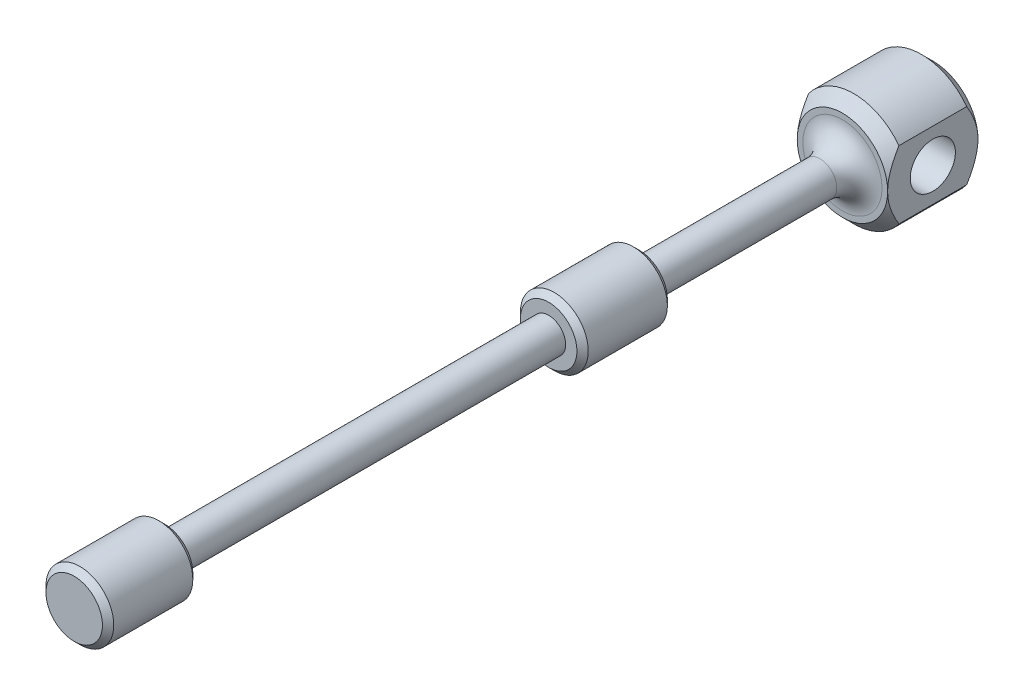
ISO-10303-21;
HEADER;
FILE_DESCRIPTION(('STEP AP214'),'2;1');
FILE_NAME('part.step','',(''),(''),'','','');
FILE_SCHEMA(('AUTOMOTIVE_DESIGN { 1 0 10303 214 1 1 1 1 }'));
ENDSEC;
DATA;
#1=APPLICATION_CONTEXT('core data for automotive mechanical design processes');
#2=APPLICATION_PROTOCOL_DEFINITION('international standard','automotive_design',2000,#1);
#3=PRODUCT_CONTEXT('',#1,'mechanical');
#4=PRODUCT('Part','Part','',(#3));
#5=PRODUCT_RELATED_PRODUCT_CATEGORY('part','',(#4));
#6=PRODUCT_DEFINITION_FORMATION('','',#4);
#7=PRODUCT_DEFINITION_CONTEXT('part definition',#1,'design');
#8=PRODUCT_DEFINITION('design','',#6,#7);
#9=PRODUCT_DEFINITION_SHAPE('','',#8);
#10=(LENGTH_UNIT() NAMED_UNIT(*) SI_UNIT(.MILLI.,.METRE.));
#11=(NAMED_UNIT(*) PLANE_ANGLE_UNIT() SI_UNIT($,.RADIAN.));
#12=(NAMED_UNIT(*) SI_UNIT($,.STERADIAN.) SOLID_ANGLE_UNIT());
#13=UNCERTAINTY_MEASURE_WITH_UNIT(LENGTH_MEASURE(1.E-05),#10,'distance_accuracy_value','');
#14=(GEOMETRIC_REPRESENTATION_CONTEXT(3) GLOBAL_UNCERTAINTY_ASSIGNED_CONTEXT((#13)) GLOBAL_UNIT_ASSIGNED_CONTEXT((#10,
#11,#12)) REPRESENTATION_CONTEXT('',''));
#15=CARTESIAN_POINT('',(0.,0.,0.));
#16=DIRECTION('',(0.,0.,1.));
#17=DIRECTION('',(1.,0.,0.));
#18=AXIS2_PLACEMENT_3D('',#15,#16,#17);
#19=CARTESIAN_POINT('',(0.,0.,-76.));
#20=DIRECTION('',(0.,0.,1.));
#21=DIRECTION('',(1.,0.,0.));
#22=AXIS2_PLACEMENT_3D('',#19,#20,#21);
#23=CYLINDRICAL_SURFACE('',#22,5.);
#24=DIRECTION('',(0.,0.,-1.));
#25=VECTOR('',#24,1.);
#26=CARTESIAN_POINT('',(-4.,3.,-68.));
#27=LINE('',#26,#25);
#28=CARTESIAN_POINT('',(-4.,3.,-69.));
#29=VERTEX_POINT('',#28);
#30=CARTESIAN_POINT('',(-4.,3.,-75.));
#31=VERTEX_POINT('',#30);
#32=EDGE_CURVE('E132',#29,#31,#27,.T.);
#33=ORIENTED_EDGE('',*,*,#32,.F.);
#34=CARTESIAN_POINT('',(0.,0.,-69.));
#35=DIRECTION('',(0.,0.,-1.));
#36=DIRECTION('',(-1.,0.,0.));
#37=AXIS2_PLACEMENT_3D('',#34,#35,#36);
#38=CIRCLE('',#37,5.);
#39=CARTESIAN_POINT('',(4.,3.,-69.));
#40=VERTEX_POINT('',#39);
#41=EDGE_CURVE('E226',#29,#40,#38,.T.);
#42=ORIENTED_EDGE('',*,*,#41,.T.);
#43=DIRECTION('',(0.,0.,1.));
#44=VECTOR('',#43,1.);
#45=CARTESIAN_POINT('',(4.,3.,-76.));
#46=LINE('',#45,#44);
#47=CARTESIAN_POINT('',(4.,3.,-75.));
#48=VERTEX_POINT('',#47);
#49=EDGE_CURVE('E131',#48,#40,#46,.T.);
#50=ORIENTED_EDGE('',*,*,#49,.F.);
#51=CARTESIAN_POINT('',(0.,0.,-75.));
#52=DIRECTION('',(0.,0.,-1.));
#53=DIRECTION('',(-1.,0.,0.));
#54=AXIS2_PLACEMENT_3D('',#51,#52,#53);
#55=CIRCLE('',#54,5.);
#56=EDGE_CURVE('E224',#48,#31,#55,.F.);
#57=ORIENTED_EDGE('',*,*,#56,.T.);
#58=EDGE_LOOP('',(#33,#42,#50,#57));
#59=FACE_BOUND('',#58,.T.);
#60=ADVANCED_FACE('F47',(#59),#23,.T.);
#61=CARTESIAN_POINT('',(0.,0.,-8.));
#62=DIRECTION('',(0.,0.,1.));
#63=DIRECTION('',(1.,0.,0.));
#64=AXIS2_PLACEMENT_3D('',#61,#62,#63);
#65=CYLINDRICAL_SURFACE('',#64,3.);
#66=CARTESIAN_POINT('',(0.,0.,-7.5));
#67=DIRECTION('',(0.,0.,1.));
#68=DIRECTION('',(1.,0.,0.));
#69=AXIS2_PLACEMENT_3D('',#66,#67,#68);
#70=CIRCLE('',#69,3.);
#71=CARTESIAN_POINT('',(3.,0.,-7.5));
#72=VERTEX_POINT('',#71);
#73=EDGE_CURVE('E243',#72,#72,#70,.T.);
#74=ORIENTED_EDGE('',*,*,#73,.T.);
#75=EDGE_LOOP('',(#74));
#76=FACE_BOUND('',#75,.T.);
#77=CARTESIAN_POINT('',(0.,0.,-0.499999999999994));
#78=DIRECTION('',(0.,0.,1.));
#79=DIRECTION('',(1.,0.,0.));
#80=AXIS2_PLACEMENT_3D('',#77,#78,#79);
#81=CIRCLE('',#80,3.);
#82=CARTESIAN_POINT('',(3.,0.,-0.499999999999994));
#83=VERTEX_POINT('',#82);
#84=EDGE_CURVE('E240',#83,#83,#81,.F.);
#85=ORIENTED_EDGE('',*,*,#84,.T.);
#86=EDGE_LOOP('',(#85));
#87=FACE_BOUND('',#86,.T.);
#88=ADVANCED_FACE('F298',(#76,#87),#65,.T.);
#89=CARTESIAN_POINT('',(0.,0.,-8.));
#90=DIRECTION('',(0.,0.,1.));
#91=DIRECTION('',(1.,0.,0.));
#92=AXIS2_PLACEMENT_3D('',#89,#90,#91);
#93=PLANE('',#92);
#94=CARTESIAN_POINT('',(0.,0.,-8.));
#95=DIRECTION('',(0.,0.,1.));
#96=DIRECTION('',(1.,0.,0.));
#97=AXIS2_PLACEMENT_3D('',#94,#95,#96);
#98=CIRCLE('',#97,2.5);
#99=CARTESIAN_POINT('',(2.5,0.,-8.));
#100=VERTEX_POINT('',#99);
#101=EDGE_CURVE('E246',#100,#100,#98,.F.);
#102=ORIENTED_EDGE('',*,*,#101,.T.);
#103=EDGE_LOOP('',(#102));
#104=FACE_BOUND('',#103,.T.);
#105=CARTESIAN_POINT('',(0.,0.,-8.));
#106=DIRECTION('',(0.,0.,-1.));
#107=DIRECTION('',(-1.,0.,0.));
#108=AXIS2_PLACEMENT_3D('',#105,#106,#107);
#109=CIRCLE('',#108,1.5);
#110=CARTESIAN_POINT('',(-1.5,0.,-8.));
#111=VERTEX_POINT('',#110);
#112=EDGE_CURVE('E146',#111,#111,#109,.T.);
#113=ORIENTED_EDGE('',*,*,#112,.F.);
#114=EDGE_LOOP('',(#113));
#115=FACE_BOUND('',#114,.T.);
#116=ADVANCED_FACE('F303',(#104,#115),#93,.F.);
#117=CARTESIAN_POINT('',(0.,0.,0.));
#118=DIRECTION('',(0.,0.,1.));
#119=DIRECTION('',(1.,0.,0.));
#120=AXIS2_PLACEMENT_3D('',#117,#118,#119);
#121=PLANE('',#120);
#122=CARTESIAN_POINT('',(0.,0.,0.));
#123=DIRECTION('',(0.,0.,1.));
#124=DIRECTION('',(1.,0.,0.));
#125=AXIS2_PLACEMENT_3D('',#122,#123,#124);
#126=CIRCLE('',#125,2.5);
#127=CARTESIAN_POINT('',(2.5,0.,0.));
#128=VERTEX_POINT('',#127);
#129=EDGE_CURVE('E249',#128,#128,#126,.T.);
#130=ORIENTED_EDGE('',*,*,#129,.T.);
#131=EDGE_LOOP('',(#130));
#132=FACE_BOUND('',#131,.T.);
#133=ADVANCED_FACE('F364',(#132),#121,.T.);
#134=CARTESIAN_POINT('',(0.,0.,-42.));
#135=DIRECTION('',(0.,0.,1.));
#136=DIRECTION('',(1.,0.,0.));
#137=AXIS2_PLACEMENT_3D('',#134,#135,#136);
#138=CYLINDRICAL_SURFACE('',#137,1.5);
#139=CARTESIAN_POINT('',(0.,0.,-42.));
#140=DIRECTION('',(0.,0.,-1.));
#141=DIRECTION('',(-1.,0.,0.));
#142=AXIS2_PLACEMENT_3D('',#139,#140,#141);
#143=CIRCLE('',#142,1.5);
#144=CARTESIAN_POINT('',(-1.5,0.,-42.));
#145=VERTEX_POINT('',#144);
#146=EDGE_CURVE('E142',#145,#145,#143,.T.);
#147=ORIENTED_EDGE('',*,*,#146,.F.);
#148=EDGE_LOOP('',(#147));
#149=FACE_BOUND('',#148,.T.);
#150=ORIENTED_EDGE('',*,*,#112,.T.);
#151=EDGE_LOOP('',(#150));
#152=FACE_BOUND('',#151,.T.);
#153=ADVANCED_FACE('F273',(#149,#152),#138,.T.);
#154=CARTESIAN_POINT('',(0.,0.,-50.));
#155=DIRECTION('',(0.,0.,1.));
#156=DIRECTION('',(1.,0.,0.));
#157=AXIS2_PLACEMENT_3D('',#154,#155,#156);
#158=CYLINDRICAL_SURFACE('',#157,3.);
#159=CARTESIAN_POINT('',(0.,0.,-42.5));
#160=DIRECTION('',(0.,0.,-1.));
#161=DIRECTION('',(-1.,0.,0.));
#162=AXIS2_PLACEMENT_3D('',#159,#160,#161);
#163=CIRCLE('',#162,3.);
#164=CARTESIAN_POINT('',(-3.,0.,-42.5));
#165=VERTEX_POINT('',#164);
#166=EDGE_CURVE('E255',#165,#165,#163,.T.);
#167=ORIENTED_EDGE('',*,*,#166,.T.);
#168=EDGE_LOOP('',(#167));
#169=FACE_BOUND('',#168,.T.);
#170=CARTESIAN_POINT('',(0.,0.,-49.5));
#171=DIRECTION('',(0.,0.,-1.));
#172=DIRECTION('',(-1.,0.,0.));
#173=AXIS2_PLACEMENT_3D('',#170,#171,#172);
#174=CIRCLE('',#173,3.);
#175=CARTESIAN_POINT('',(-3.,0.,-49.5));
#176=VERTEX_POINT('',#175);
#177=EDGE_CURVE('E252',#176,#176,#174,.F.);
#178=ORIENTED_EDGE('',*,*,#177,.T.);
#179=EDGE_LOOP('',(#178));
#180=FACE_BOUND('',#179,.T.);
#181=ADVANCED_FACE('F269',(#169,#180),#158,.T.);
#182=CARTESIAN_POINT('',(0.,0.,-50.));
#183=DIRECTION('',(0.,0.,-1.));
#184=DIRECTION('',(-1.,0.,0.));
#185=AXIS2_PLACEMENT_3D('',#182,#183,#184);
#186=PLANE('',#185);
#187=CARTESIAN_POINT('',(0.,0.,-50.));
#188=DIRECTION('',(0.,0.,-1.));
#189=DIRECTION('',(-1.,0.,0.));
#190=AXIS2_PLACEMENT_3D('',#187,#188,#189);
#191=CIRCLE('',#190,2.5);
#192=CARTESIAN_POINT('',(-2.5,0.,-50.));
#193=VERTEX_POINT('',#192);
#194=EDGE_CURVE('E11',#193,#193,#191,.T.);
#195=ORIENTED_EDGE('',*,*,#194,.T.);
#196=EDGE_LOOP('',(#195));
#197=FACE_BOUND('',#196,.T.);
#198=CARTESIAN_POINT('',(0.,0.,-50.));
#199=DIRECTION('',(0.,0.,-1.));
#200=DIRECTION('',(-1.,0.,0.));
#201=AXIS2_PLACEMENT_3D('',#198,#199,#200);
#202=CIRCLE('',#201,1.5);
#203=CARTESIAN_POINT('',(-1.5,0.,-50.));
#204=VERTEX_POINT('',#203);
#205=EDGE_CURVE('E143',#204,#204,#202,.T.);
#206=ORIENTED_EDGE('',*,*,#205,.F.);
#207=EDGE_LOOP('',(#206));
#208=FACE_BOUND('',#207,.T.);
#209=ADVANCED_FACE('F272',(#197,#208),#186,.T.);
#210=CARTESIAN_POINT('',(0.,0.,-42.));
#211=DIRECTION('',(0.,0.,-1.));
#212=DIRECTION('',(-1.,0.,0.));
#213=AXIS2_PLACEMENT_3D('',#210,#211,#212);
#214=PLANE('',#213);
#215=CARTESIAN_POINT('',(0.,0.,-42.));
#216=DIRECTION('',(0.,0.,-1.));
#217=DIRECTION('',(-1.,0.,0.));
#218=AXIS2_PLACEMENT_3D('',#215,#216,#217);
#219=CIRCLE('',#218,2.49999999999999);
#220=CARTESIAN_POINT('',(-2.49999999999999,0.,-42.));
#221=VERTEX_POINT('',#220);
#222=EDGE_CURVE('E56',#221,#221,#219,.F.);
#223=ORIENTED_EDGE('',*,*,#222,.T.);
#224=EDGE_LOOP('',(#223));
#225=FACE_BOUND('',#224,.T.);
#226=ORIENTED_EDGE('',*,*,#146,.T.);
#227=EDGE_LOOP('',(#226));
#228=FACE_BOUND('',#227,.T.);
#229=ADVANCED_FACE('F260',(#225,#228),#214,.F.);
#230=CARTESIAN_POINT('',(0.,0.,-68.));
#231=DIRECTION('',(0.,0.,1.));
#232=DIRECTION('',(1.,0.,0.));
#233=AXIS2_PLACEMENT_3D('',#230,#231,#232);
#234=CYLINDRICAL_SURFACE('',#233,1.5);
#235=CARTESIAN_POINT('',(0.,0.,-66.));
#236=DIRECTION('',(0.,0.,-1.));
#237=DIRECTION('',(-1.,0.,0.));
#238=AXIS2_PLACEMENT_3D('',#235,#236,#237);
#239=CIRCLE('',#238,1.5);
#240=CARTESIAN_POINT('',(-1.5,0.,-66.));
#241=VERTEX_POINT('',#240);
#242=EDGE_CURVE('E237',#241,#241,#239,.F.);
#243=ORIENTED_EDGE('',*,*,#242,.T.);
#244=EDGE_LOOP('',(#243));
#245=FACE_BOUND('',#244,.T.);
#246=ORIENTED_EDGE('',*,*,#205,.T.);
#247=EDGE_LOOP('',(#246));
#248=FACE_BOUND('',#247,.T.);
#249=ADVANCED_FACE('F286',(#245,#248),#234,.T.);
#250=DIRECTION('',(0.,0.,1.));
#251=VECTOR('',#250,1.);
#252=CARTESIAN_POINT('',(4.,-3.,-76.));
#253=LINE('',#252,#251);
#254=CARTESIAN_POINT('',(4.,-3.,-75.));
#255=VERTEX_POINT('',#254);
#256=CARTESIAN_POINT('',(4.,-3.,-69.));
#257=VERTEX_POINT('',#256);
#258=EDGE_CURVE('E124',#255,#257,#253,.T.);
#259=ORIENTED_EDGE('',*,*,#258,.T.);
#260=CARTESIAN_POINT('',(0.,0.,-69.));
#261=DIRECTION('',(0.,0.,-1.));
#262=DIRECTION('',(-1.,0.,0.));
#263=AXIS2_PLACEMENT_3D('',#260,#261,#262);
#264=CIRCLE('',#263,5.);
#265=CARTESIAN_POINT('',(-4.,-3.,-69.));
#266=VERTEX_POINT('',#265);
#267=EDGE_CURVE('E108',#257,#266,#264,.T.);
#268=ORIENTED_EDGE('',*,*,#267,.T.);
#269=DIRECTION('',(0.,0.,-1.));
#270=VECTOR('',#269,1.);
#271=CARTESIAN_POINT('',(-4.,-3.,-68.));
#272=LINE('',#271,#270);
#273=CARTESIAN_POINT('',(-4.,-3.,-75.));
#274=VERTEX_POINT('',#273);
#275=EDGE_CURVE('E121',#266,#274,#272,.T.);
#276=ORIENTED_EDGE('',*,*,#275,.T.);
#277=CARTESIAN_POINT('',(0.,0.,-75.));
#278=DIRECTION('',(0.,0.,-1.));
#279=DIRECTION('',(-1.,0.,0.));
#280=AXIS2_PLACEMENT_3D('',#277,#278,#279);
#281=CIRCLE('',#280,5.);
#282=EDGE_CURVE('E126',#274,#255,#281,.F.);
#283=ORIENTED_EDGE('',*,*,#282,.T.);
#284=EDGE_LOOP('',(#259,#268,#276,#283));
#285=FACE_BOUND('',#284,.T.);
#286=ADVANCED_FACE('F120',(#285),#23,.T.);
#287=CARTESIAN_POINT('',(0.,0.,-76.));
#288=DIRECTION('',(0.,0.,-1.));
#289=DIRECTION('',(-1.,0.,0.));
#290=AXIS2_PLACEMENT_3D('',#287,#288,#289);
#291=PLANE('',#290);
#292=CARTESIAN_POINT('',(0.,0.,-76.));
#293=DIRECTION('',(0.,0.,-1.));
#294=DIRECTION('',(-1.,0.,0.));
#295=AXIS2_PLACEMENT_3D('',#292,#293,#294);
#296=CIRCLE('',#295,4.);
#297=CARTESIAN_POINT('',(-4.,0.,-76.));
#298=VERTEX_POINT('',#297);
#299=CARTESIAN_POINT('',(4.,0.,-76.));
#300=VERTEX_POINT('',#299);
#301=EDGE_CURVE('E228',#298,#300,#296,.T.);
#302=ORIENTED_EDGE('',*,*,#301,.T.);
#303=CARTESIAN_POINT('',(0.,0.,-76.));
#304=DIRECTION('',(0.,0.,-1.));
#305=DIRECTION('',(-1.,0.,0.));
#306=AXIS2_PLACEMENT_3D('',#303,#304,#305);
#307=CIRCLE('',#306,4.);
#308=EDGE_CURVE('E231',#300,#298,#307,.T.);
#309=ORIENTED_EDGE('',*,*,#308,.T.);
#310=EDGE_LOOP('',(#302,#309));
#311=FACE_BOUND('',#310,.T.);
#312=ADVANCED_FACE('F294',(#311),#291,.T.);
#313=CARTESIAN_POINT('',(0.,0.,-68.));
#314=DIRECTION('',(0.,0.,-1.));
#315=DIRECTION('',(-1.,0.,0.));
#316=AXIS2_PLACEMENT_3D('',#313,#314,#315);
#317=PLANE('',#316);
#318=CARTESIAN_POINT('',(0.,0.,-68.));
#319=DIRECTION('',(0.,0.,-1.));
#320=DIRECTION('',(-1.,0.,0.));
#321=AXIS2_PLACEMENT_3D('',#318,#319,#320);
#322=CIRCLE('',#321,3.5);
#323=CARTESIAN_POINT('',(-3.5,0.,-68.));
#324=VERTEX_POINT('',#323);
#325=EDGE_CURVE('E234',#324,#324,#322,.T.);
#326=ORIENTED_EDGE('',*,*,#325,.T.);
#327=EDGE_LOOP('',(#326));
#328=FACE_BOUND('',#327,.T.);
#329=CARTESIAN_POINT('',(0.,0.,-68.));
#330=DIRECTION('',(0.,0.,-1.));
#331=DIRECTION('',(-1.,0.,0.));
#332=AXIS2_PLACEMENT_3D('',#329,#330,#331);
#333=CIRCLE('',#332,4.);
#334=CARTESIAN_POINT('',(4.,0.,-68.));
#335=VERTEX_POINT('',#334);
#336=CARTESIAN_POINT('',(-4.,0.,-68.));
#337=VERTEX_POINT('',#336);
#338=EDGE_CURVE('E114',#335,#337,#333,.F.);
#339=ORIENTED_EDGE('',*,*,#338,.T.);
#340=CARTESIAN_POINT('',(0.,0.,-68.));
#341=DIRECTION('',(0.,0.,-1.));
#342=DIRECTION('',(-1.,0.,0.));
#343=AXIS2_PLACEMENT_3D('',#340,#341,#342);
#344=CIRCLE('',#343,4.);
#345=EDGE_CURVE('E110',#337,#335,#344,.F.);
#346=ORIENTED_EDGE('',*,*,#345,.T.);
#347=EDGE_LOOP('',(#339,#346));
#348=FACE_BOUND('',#347,.T.);
#349=ADVANCED_FACE('F307',(#328,#348),#317,.F.);
#350=CARTESIAN_POINT('',(4.,3.,-76.));
#351=DIRECTION('',(-1.,0.,0.));
#352=DIRECTION('',(0.,0.,1.));
#353=AXIS2_PLACEMENT_3D('',#350,#351,#352);
#354=PLANE('',#353);
#355=CARTESIAN_POINT('',(4.,0.,-72.));
#356=DIRECTION('',(1.,0.,0.));
#357=DIRECTION('',(0.,0.,-1.));
#358=AXIS2_PLACEMENT_3D('',#355,#356,#357);
#359=CIRCLE('',#358,2.);
#360=CARTESIAN_POINT('',(4.,0.,-74.));
#361=VERTEX_POINT('',#360);
#362=EDGE_CURVE('E545',#361,#361,#359,.T.);
#363=ORIENTED_EDGE('',*,*,#362,.F.);
#364=EDGE_LOOP('',(#363));
#365=FACE_BOUND('',#364,.T.);
#366=CARTESIAN_POINT('',(4.,3.,-69.));
#367=CARTESIAN_POINT('',(4.,2.92762836200348,-68.956581405577));
#368=CARTESIAN_POINT('',(4.,2.85481802742839,-68.9138959485449));
#369=CARTESIAN_POINT('',(4.,2.70821938275152,-68.83019894129));
#370=CARTESIAN_POINT('',(4.,2.63443084222755,-68.7891877950874));
#371=CARTESIAN_POINT('',(4.,2.41100406792378,-68.6687412261486));
#372=CARTESIAN_POINT('',(4.,2.25978602411567,-68.5921850767644));
#373=CARTESIAN_POINT('',(4.,1.95659067359726,-68.450923903765));
#374=CARTESIAN_POINT('',(4.,1.80473273623763,-68.3859648909348));
#375=CARTESIAN_POINT('',(4.,1.49644202508003,-68.2683839947351));
#376=CARTESIAN_POINT('',(4.,1.34001590275358,-68.2157450905884));
#377=CARTESIAN_POINT('',(4.,1.08612110951739,-68.1438275437783));
#378=CARTESIAN_POINT('',(4.,0.990042302625628,-68.1196197271478));
#379=CARTESIAN_POINT('',(4.,0.79652086281377,-68.0774412059882));
#380=CARTESIAN_POINT('',(4.,0.699078403289656,-68.0594697158391));
#381=CARTESIAN_POINT('',(4.,0.501704347689406,-68.0301457323276));
#382=CARTESIAN_POINT('',(4.,0.401757304518333,-68.0188959865408));
#383=CARTESIAN_POINT('',(4.,0.201215242114625,-68.0037953128905));
#384=CARTESIAN_POINT('',(4.,0.100619701668967,-67.999951356772));
#385=CARTESIAN_POINT('',(4.,0.,-68.));
#386=B_SPLINE_CURVE_WITH_KNOTS('',3,(#366,#367,#368,#369,#370,#371,#372,#373,#374,#375,#376,
#377,#378,#379,#380,#381,#382,#383,#384,#385),.UNSPECIFIED.,.F.,.F.,(4,2,2,2,2,2,2,2,2,4),(0.,
0.253181371589515,0.506423480383852,1.01459556294123,1.50970891621841,2.00413415664268,
2.30120350256041,2.59823541162859,2.89969868702638,3.20144561888665),.UNSPECIFIED.);
#387=EDGE_CURVE('E63',#40,#335,#386,.T.);
#388=ORIENTED_EDGE('',*,*,#387,.T.);
#389=CARTESIAN_POINT('',(4.,0.,-68.));
#390=CARTESIAN_POINT('',(4.,-0.0614896821712425,-67.999995048581));
#391=CARTESIAN_POINT('',(4.,-0.122970237034905,-68.0014185758096));
#392=CARTESIAN_POINT('',(4.,-0.2457922689549,-68.0070760257621));
#393=CARTESIAN_POINT('',(4.,-0.307133766863006,-68.0113094947052));
#394=CARTESIAN_POINT('',(4.,-0.490538519574091,-68.0281318667512));
#395=CARTESIAN_POINT('',(4.,-0.612243847557191,-68.0448431319862));
#396=CARTESIAN_POINT('',(4.,-0.851773849884559,-68.0880127467617));
#397=CARTESIAN_POINT('',(4.,-0.969629397394424,-68.1143041589317));
#398=CARTESIAN_POINT('',(4.,-1.20311028898421,-68.1754966667891));
#399=CARTESIAN_POINT('',(4.,-1.31873469194052,-68.2104013135961));
#400=CARTESIAN_POINT('',(4.,-1.56915278958546,-68.2948602113957));
#401=CARTESIAN_POINT('',(4.,-1.70342909226877,-68.3459370048148));
#402=CARTESIAN_POINT('',(4.,-1.96849997837182,-68.4565094208477));
#403=CARTESIAN_POINT('',(4.,-2.09929282991421,-68.516009141589));
#404=CARTESIAN_POINT('',(4.,-2.36033095148102,-68.6430430444663));
#405=CARTESIAN_POINT('',(4.,-2.49050544053603,-68.7107211665127));
#406=CARTESIAN_POINT('',(4.,-2.74756392847844,-68.8515677946968));
#407=CARTESIAN_POINT('',(4.,-2.87445330157051,-68.9247264560827));
#408=CARTESIAN_POINT('',(4.,-3.,-69.));
#409=B_SPLINE_CURVE_WITH_KNOTS('',3,(#389,#390,#391,#392,#393,#394,#395,#396,#397,#398,#399,
#400,#401,#402,#403,#404,#405,#406,#407,#408),.UNSPECIFIED.,.F.,.F.,(4,2,2,2,2,2,2,2,2,4),(0.,
0.184435127504875,0.368840477618773,0.736868694951193,1.0987686824657,1.46081812644689,
1.89144466887991,2.32228145495383,2.76227942763344,3.20150515183777),.UNSPECIFIED.);
#410=EDGE_CURVE('E212',#335,#257,#409,.T.);
#411=ORIENTED_EDGE('',*,*,#410,.T.);
#412=ORIENTED_EDGE('',*,*,#258,.F.);
#413=CARTESIAN_POINT('',(4.,-3.,-75.));
#414=CARTESIAN_POINT('',(4.,-2.92762836200348,-75.0434185944231));
#415=CARTESIAN_POINT('',(4.,-2.85481802742839,-75.0861040514551));
#416=CARTESIAN_POINT('',(4.,-2.70821938275153,-75.16980105871));
#417=CARTESIAN_POINT('',(4.,-2.63443084222756,-75.2108122049127));
#418=CARTESIAN_POINT('',(4.,-2.41100406792379,-75.3312587738514));
#419=CARTESIAN_POINT('',(4.,-2.25978602411567,-75.4078149232356));
#420=CARTESIAN_POINT('',(4.,-1.95659067359726,-75.549076096235));
#421=CARTESIAN_POINT('',(4.,-1.80473273623763,-75.6140351090652));
#422=CARTESIAN_POINT('',(4.,-1.49644202508003,-75.7316160052649));
#423=CARTESIAN_POINT('',(4.,-1.34001590275358,-75.7842549094116));
#424=CARTESIAN_POINT('',(4.,-1.08612110951739,-75.8561724562217));
#425=CARTESIAN_POINT('',(4.,-0.990042302625629,-75.8803802728522));
#426=CARTESIAN_POINT('',(4.,-0.796520862813771,-75.9225587940118));
#427=CARTESIAN_POINT('',(4.,-0.699078403289656,-75.9405302841609));
#428=CARTESIAN_POINT('',(4.,-0.501704347689405,-75.9698542676724));
#429=CARTESIAN_POINT('',(4.,-0.401757304518332,-75.9811040134592));
#430=CARTESIAN_POINT('',(4.,-0.201215242114624,-75.9962046871095));
#431=CARTESIAN_POINT('',(4.,-0.100619701668965,-76.000048643228));
#432=CARTESIAN_POINT('',(4.,0.,-76.));
#433=B_SPLINE_CURVE_WITH_KNOTS('',3,(#413,#414,#415,#416,#417,#418,#419,#420,#421,#422,#423,
#424,#425,#426,#427,#428,#429,#430,#431,#432),.UNSPECIFIED.,.F.,.F.,(4,2,2,2,2,2,2,2,2,4),(0.,
0.253181371589513,0.506423480383849,1.01459556294123,1.5097089162184,2.00413415664268,
2.30120350256041,2.5982354116286,2.89969868702638,3.20144561888666),.UNSPECIFIED.);
#434=EDGE_CURVE('E213',#255,#300,#433,.T.);
#435=ORIENTED_EDGE('',*,*,#434,.T.);
#436=CARTESIAN_POINT('',(4.,0.,-76.));
#437=CARTESIAN_POINT('',(4.,0.061489682171242,-76.000004951419));
#438=CARTESIAN_POINT('',(4.,0.122970237034905,-75.9985814241904));
#439=CARTESIAN_POINT('',(4.,0.2457922689549,-75.9929239742379));
#440=CARTESIAN_POINT('',(4.,0.307133766863006,-75.9886905052948));
#441=CARTESIAN_POINT('',(4.,0.490538519574091,-75.9718681332489));
#442=CARTESIAN_POINT('',(4.,0.61224384755719,-75.9551568680138));
#443=CARTESIAN_POINT('',(4.,0.851773849884557,-75.9119872532383));
#444=CARTESIAN_POINT('',(4.,0.96962939739442,-75.8856958410683));
#445=CARTESIAN_POINT('',(4.,1.2031102889842,-75.824503333211));
#446=CARTESIAN_POINT('',(4.,1.31873469194052,-75.789598686404));
#447=CARTESIAN_POINT('',(4.,1.56915278958545,-75.7051397886043));
#448=CARTESIAN_POINT('',(4.,1.70342909226875,-75.6540629951852));
#449=CARTESIAN_POINT('',(4.,1.9684999783718,-75.5434905791523));
#450=CARTESIAN_POINT('',(4.,2.0992928299142,-75.4839908584111));
#451=CARTESIAN_POINT('',(4.,2.36033095148101,-75.3569569555337));
#452=CARTESIAN_POINT('',(4.,2.49050544053602,-75.2892788334873));
#453=CARTESIAN_POINT('',(4.,2.74756392847844,-75.1484322053032));
#454=CARTESIAN_POINT('',(4.,2.8744533015705,-75.0752735439173));
#455=CARTESIAN_POINT('',(4.,3.,-75.));
#456=B_SPLINE_CURVE_WITH_KNOTS('',3,(#436,#437,#438,#439,#440,#441,#442,#443,#444,#445,#446,
#447,#448,#449,#450,#451,#452,#453,#454,#455),.UNSPECIFIED.,.F.,.F.,(4,2,2,2,2,2,2,2,2,4),(0.,
0.184435127504875,0.368840477618771,0.736868694951192,1.0987686824657,1.46081812644688,
1.89144466887989,2.32228145495381,2.76227942763344,3.20150515183777),.UNSPECIFIED.);
#457=EDGE_CURVE('E71',#300,#48,#456,.T.);
#458=ORIENTED_EDGE('',*,*,#457,.T.);
#459=ORIENTED_EDGE('',*,*,#49,.T.);
#460=EDGE_LOOP('',(#388,#411,#412,#435,#458,#459));
#461=FACE_BOUND('',#460,.T.);
#462=ADVANCED_FACE('F174',(#365,#461),#354,.F.);
#463=CARTESIAN_POINT('',(-4.,3.,-68.));
#464=DIRECTION('',(1.,0.,0.));
#465=DIRECTION('',(0.,0.,-1.));
#466=AXIS2_PLACEMENT_3D('',#463,#464,#465);
#467=PLANE('',#466);
#468=CARTESIAN_POINT('',(-4.,0.,-72.));
#469=DIRECTION('',(1.,0.,0.));
#470=DIRECTION('',(0.,0.,-1.));
#471=AXIS2_PLACEMENT_3D('',#468,#469,#470);
#472=CIRCLE('',#471,2.);
#473=CARTESIAN_POINT('',(-4.,0.,-74.));
#474=VERTEX_POINT('',#473);
#475=EDGE_CURVE('E136',#474,#474,#472,.T.);
#476=ORIENTED_EDGE('',*,*,#475,.T.);
#477=EDGE_LOOP('',(#476));
#478=FACE_BOUND('',#477,.T.);
#479=ORIENTED_EDGE('',*,*,#275,.F.);
#480=CARTESIAN_POINT('',(-4.,-3.,-69.));
#481=CARTESIAN_POINT('',(-4.,-2.92762836200347,-68.956581405577));
#482=CARTESIAN_POINT('',(-4.,-2.85481802742838,-68.9138959485449));
#483=CARTESIAN_POINT('',(-4.,-2.70821938275152,-68.83019894129));
#484=CARTESIAN_POINT('',(-4.,-2.63443084222755,-68.7891877950873));
#485=CARTESIAN_POINT('',(-4.,-2.41100406792378,-68.6687412261486));
#486=CARTESIAN_POINT('',(-4.,-2.25978602411566,-68.5921850767644));
#487=CARTESIAN_POINT('',(-4.,-1.95659067359725,-68.450923903765));
#488=CARTESIAN_POINT('',(-4.,-1.80473273623762,-68.3859648909348));
#489=CARTESIAN_POINT('',(-4.,-1.49644202508002,-68.2683839947351));
#490=CARTESIAN_POINT('',(-4.,-1.34001590275357,-68.2157450905884));
#491=CARTESIAN_POINT('',(-4.,-1.08612110951737,-68.1438275437783));
#492=CARTESIAN_POINT('',(-4.,-0.990042302625611,-68.1196197271478));
#493=CARTESIAN_POINT('',(-4.,-0.796520862813756,-68.0774412059882));
#494=CARTESIAN_POINT('',(-4.,-0.699078403289645,-68.0594697158391));
#495=CARTESIAN_POINT('',(-4.,-0.501704347689398,-68.0301457323276));
#496=CARTESIAN_POINT('',(-4.,-0.401757304518327,-68.0188959865408));
#497=CARTESIAN_POINT('',(-4.,-0.201215242114623,-68.0037953128905));
#498=CARTESIAN_POINT('',(-4.,-0.100619701668966,-67.999951356772));
#499=CARTESIAN_POINT('',(-4.,0.,-68.));
#500=B_SPLINE_CURVE_WITH_KNOTS('',3,(#480,#481,#482,#483,#484,#485,#486,#487,#488,#489,#490,
#491,#492,#493,#494,#495,#496,#497,#498,#499),.UNSPECIFIED.,.F.,.F.,(4,2,2,2,2,2,2,2,2,4),(0.,
0.253181371589518,0.506423480383859,1.01459556294124,1.50970891621841,2.00413415664269,
2.30120350256042,2.5982354116286,2.89969868702638,3.20144561888665),.UNSPECIFIED.);
#501=EDGE_CURVE('E104',#266,#337,#500,.T.);
#502=ORIENTED_EDGE('',*,*,#501,.T.);
#503=CARTESIAN_POINT('',(-4.,0.,-68.));
#504=CARTESIAN_POINT('',(-4.,0.0614896821712424,-67.999995048581));
#505=CARTESIAN_POINT('',(-4.,0.122970237034905,-68.0014185758096));
#506=CARTESIAN_POINT('',(-4.,0.2457922689549,-68.0070760257621));
#507=CARTESIAN_POINT('',(-4.,0.307133766863006,-68.0113094947052));
#508=CARTESIAN_POINT('',(-4.,0.490538519574091,-68.0281318667512));
#509=CARTESIAN_POINT('',(-4.,0.612243847557191,-68.0448431319862));
#510=CARTESIAN_POINT('',(-4.,0.85177384988456,-68.0880127467617));
#511=CARTESIAN_POINT('',(-4.,0.969629397394423,-68.1143041589317));
#512=CARTESIAN_POINT('',(-4.,1.20311028898421,-68.1754966667891));
#513=CARTESIAN_POINT('',(-4.,1.31873469194052,-68.2104013135961));
#514=CARTESIAN_POINT('',(-4.,1.56915278958546,-68.2948602113957));
#515=CARTESIAN_POINT('',(-4.,1.70342909226877,-68.3459370048148));
#516=CARTESIAN_POINT('',(-4.,1.96849997837182,-68.4565094208477));
#517=CARTESIAN_POINT('',(-4.,2.09929282991421,-68.516009141589));
#518=CARTESIAN_POINT('',(-4.,2.36033095148102,-68.6430430444663));
#519=CARTESIAN_POINT('',(-4.,2.49050544053603,-68.7107211665127));
#520=CARTESIAN_POINT('',(-4.,2.74756392847844,-68.8515677946968));
#521=CARTESIAN_POINT('',(-4.,2.87445330157051,-68.9247264560827));
#522=CARTESIAN_POINT('',(-4.,3.,-69.));
#523=B_SPLINE_CURVE_WITH_KNOTS('',3,(#503,#504,#505,#506,#507,#508,#509,#510,#511,#512,#513,
#514,#515,#516,#517,#518,#519,#520,#521,#522),.UNSPECIFIED.,.F.,.F.,(4,2,2,2,2,2,2,2,2,4),(0.,
0.184435127504875,0.368840477618773,0.736868694951193,1.0987686824657,1.46081812644689,
1.89144466887991,2.32228145495383,2.76227942763344,3.20150515183777),.UNSPECIFIED.);
#524=EDGE_CURVE('E115',#337,#29,#523,.T.);
#525=ORIENTED_EDGE('',*,*,#524,.T.);
#526=ORIENTED_EDGE('',*,*,#32,.T.);
#527=CARTESIAN_POINT('',(-4.,3.,-75.));
#528=CARTESIAN_POINT('',(-4.,2.92762836200348,-75.0434185944231));
#529=CARTESIAN_POINT('',(-4.,2.85481802742838,-75.0861040514551));
#530=CARTESIAN_POINT('',(-4.,2.70821938275152,-75.16980105871));
#531=CARTESIAN_POINT('',(-4.,2.63443084222755,-75.2108122049127));
#532=CARTESIAN_POINT('',(-4.,2.41100406792379,-75.3312587738515));
#533=CARTESIAN_POINT('',(-4.,2.25978602411567,-75.4078149232356));
#534=CARTESIAN_POINT('',(-4.,1.95659067359726,-75.549076096235));
#535=CARTESIAN_POINT('',(-4.,1.80473273623763,-75.6140351090652));
#536=CARTESIAN_POINT('',(-4.,1.49644202508003,-75.7316160052649));
#537=CARTESIAN_POINT('',(-4.,1.34001590275358,-75.7842549094116));
#538=CARTESIAN_POINT('',(-4.,1.08612110951738,-75.8561724562217));
#539=CARTESIAN_POINT('',(-4.,0.990042302625622,-75.8803802728522));
#540=CARTESIAN_POINT('',(-4.,0.796520862813765,-75.9225587940118));
#541=CARTESIAN_POINT('',(-4.,0.699078403289651,-75.9405302841609));
#542=CARTESIAN_POINT('',(-4.,0.501704347689401,-75.9698542676724));
#543=CARTESIAN_POINT('',(-4.,0.401757304518329,-75.9811040134592));
#544=CARTESIAN_POINT('',(-4.,0.201215242114622,-75.9962046871095));
#545=CARTESIAN_POINT('',(-4.,0.100619701668962,-76.000048643228));
#546=CARTESIAN_POINT('',(-4.,0.,-76.));
#547=B_SPLINE_CURVE_WITH_KNOTS('',3,(#527,#528,#529,#530,#531,#532,#533,#534,#535,#536,#537,
#538,#539,#540,#541,#542,#543,#544,#545,#546),.UNSPECIFIED.,.F.,.F.,(4,2,2,2,2,2,2,2,2,4),(0.,
0.253181371589517,0.506423480383856,1.01459556294123,1.50970891621841,2.00413415664268,
2.30120350256042,2.5982354116286,2.89969868702638,3.20144561888666),.UNSPECIFIED.);
#548=EDGE_CURVE('E125',#31,#298,#547,.T.);
#549=ORIENTED_EDGE('',*,*,#548,.T.);
#550=CARTESIAN_POINT('',(-4.,0.,-76.));
#551=CARTESIAN_POINT('',(-4.,-0.0614896821712419,-76.000004951419));
#552=CARTESIAN_POINT('',(-4.,-0.122970237034905,-75.9985814241904));
#553=CARTESIAN_POINT('',(-4.,-0.2457922689549,-75.9929239742379));
#554=CARTESIAN_POINT('',(-4.,-0.307133766863005,-75.9886905052948));
#555=CARTESIAN_POINT('',(-4.,-0.490538519574091,-75.9718681332489));
#556=CARTESIAN_POINT('',(-4.,-0.61224384755719,-75.9551568680138));
#557=CARTESIAN_POINT('',(-4.,-0.851773849884557,-75.9119872532383));
#558=CARTESIAN_POINT('',(-4.,-0.96962939739442,-75.8856958410683));
#559=CARTESIAN_POINT('',(-4.,-1.2031102889842,-75.824503333211));
#560=CARTESIAN_POINT('',(-4.,-1.31873469194052,-75.789598686404));
#561=CARTESIAN_POINT('',(-4.,-1.56915278958545,-75.7051397886043));
#562=CARTESIAN_POINT('',(-4.,-1.70342909226875,-75.6540629951852));
#563=CARTESIAN_POINT('',(-4.,-1.9684999783718,-75.5434905791523));
#564=CARTESIAN_POINT('',(-4.,-2.0992928299142,-75.4839908584111));
#565=CARTESIAN_POINT('',(-4.,-2.36033095148101,-75.3569569555337));
#566=CARTESIAN_POINT('',(-4.,-2.49050544053602,-75.2892788334873));
#567=CARTESIAN_POINT('',(-4.,-2.74756392847844,-75.1484322053032));
#568=CARTESIAN_POINT('',(-4.,-2.8744533015705,-75.0752735439173));
#569=CARTESIAN_POINT('',(-4.,-3.,-75.));
#570=B_SPLINE_CURVE_WITH_KNOTS('',3,(#550,#551,#552,#553,#554,#555,#556,#557,#558,#559,#560,
#561,#562,#563,#564,#565,#566,#567,#568,#569),.UNSPECIFIED.,.F.,.F.,(4,2,2,2,2,2,2,2,2,4),(0.,
0.184435127504875,0.368840477618771,0.736868694951192,1.0987686824657,1.46081812644688,
1.89144466887989,2.32228145495381,2.76227942763343,3.20150515183777),.UNSPECIFIED.);
#571=EDGE_CURVE('E130',#298,#274,#570,.T.);
#572=ORIENTED_EDGE('',*,*,#571,.T.);
#573=EDGE_LOOP('',(#479,#502,#525,#526,#549,#572));
#574=FACE_BOUND('',#573,.T.);
#575=ADVANCED_FACE('F128',(#478,#574),#467,.F.);
#576=CARTESIAN_POINT('',(-4.,0.,-72.));
#577=DIRECTION('',(1.,0.,0.));
#578=DIRECTION('',(0.,0.,-1.));
#579=AXIS2_PLACEMENT_3D('',#576,#577,#578);
#580=CYLINDRICAL_SURFACE('',#579,2.);
#581=ORIENTED_EDGE('',*,*,#475,.F.);
#582=EDGE_LOOP('',(#581));
#583=FACE_BOUND('',#582,.T.);
#584=ORIENTED_EDGE('',*,*,#362,.T.);
#585=EDGE_LOOP('',(#584));
#586=FACE_BOUND('',#585,.T.);
#587=ADVANCED_FACE('F173',(#583,#586),#580,.F.);
#588=CARTESIAN_POINT('',(0.,0.,-69.));
#589=DIRECTION('',(0.,0.,-1.));
#590=DIRECTION('',(-1.,0.,0.));
#591=AXIS2_PLACEMENT_3D('',#588,#589,#590);
#592=CONICAL_SURFACE('',#591,5.,0.785398163397443);
#593=ORIENTED_EDGE('',*,*,#410,.F.);
#594=ORIENTED_EDGE('',*,*,#345,.F.);
#595=ORIENTED_EDGE('',*,*,#501,.F.);
#596=ORIENTED_EDGE('',*,*,#267,.F.);
#597=EDGE_LOOP('',(#593,#594,#595,#596));
#598=FACE_BOUND('',#597,.T.);
#599=ADVANCED_FACE('F107',(#598),#592,.T.);
#600=CARTESIAN_POINT('',(0.,0.,-69.));
#601=DIRECTION('',(0.,0.,-1.));
#602=DIRECTION('',(-1.,0.,0.));
#603=AXIS2_PLACEMENT_3D('',#600,#601,#602);
#604=CONICAL_SURFACE('',#603,5.,0.785398163397443);
#605=ORIENTED_EDGE('',*,*,#524,.F.);
#606=ORIENTED_EDGE('',*,*,#338,.F.);
#607=ORIENTED_EDGE('',*,*,#387,.F.);
#608=ORIENTED_EDGE('',*,*,#41,.F.);
#609=EDGE_LOOP('',(#605,#606,#607,#608));
#610=FACE_BOUND('',#609,.T.);
#611=ADVANCED_FACE('F193',(#610),#604,.T.);
#612=CARTESIAN_POINT('',(0.,0.,-76.));
#613=DIRECTION('',(0.,0.,1.));
#614=DIRECTION('',(1.,0.,0.));
#615=AXIS2_PLACEMENT_3D('',#612,#613,#614);
#616=CONICAL_SURFACE('',#615,4.,0.785398163397439);
#617=ORIENTED_EDGE('',*,*,#434,.F.);
#618=ORIENTED_EDGE('',*,*,#282,.F.);
#619=ORIENTED_EDGE('',*,*,#571,.F.);
#620=ORIENTED_EDGE('',*,*,#308,.F.);
#621=EDGE_LOOP('',(#617,#618,#619,#620));
#622=FACE_BOUND('',#621,.T.);
#623=ADVANCED_FACE('F200',(#622),#616,.T.);
#624=CARTESIAN_POINT('',(0.,0.,-76.));
#625=DIRECTION('',(0.,0.,1.));
#626=DIRECTION('',(1.,0.,0.));
#627=AXIS2_PLACEMENT_3D('',#624,#625,#626);
#628=CONICAL_SURFACE('',#627,4.,0.785398163397439);
#629=ORIENTED_EDGE('',*,*,#548,.F.);
#630=ORIENTED_EDGE('',*,*,#56,.F.);
#631=ORIENTED_EDGE('',*,*,#457,.F.);
#632=ORIENTED_EDGE('',*,*,#301,.F.);
#633=EDGE_LOOP('',(#629,#630,#631,#632));
#634=FACE_BOUND('',#633,.T.);
#635=ADVANCED_FACE('F166',(#634),#628,.T.);
#636=CARTESIAN_POINT('',(0.,0.,-66.));
#637=DIRECTION('',(0.,0.,-1.));
#638=DIRECTION('',(-1.,0.,0.));
#639=AXIS2_PLACEMENT_3D('',#636,#637,#638);
#640=TOROIDAL_SURFACE('',#639,3.5,2.);
#641=ORIENTED_EDGE('',*,*,#242,.F.);
#642=EDGE_LOOP('',(#641));
#643=FACE_BOUND('',#642,.T.);
#644=ORIENTED_EDGE('',*,*,#325,.F.);
#645=EDGE_LOOP('',(#644));
#646=FACE_BOUND('',#645,.T.);
#647=ADVANCED_FACE('F324',(#643,#646),#640,.F.);
#648=CARTESIAN_POINT('',(0.,0.,-7.5));
#649=DIRECTION('',(0.,0.,1.));
#650=DIRECTION('',(1.,0.,0.));
#651=AXIS2_PLACEMENT_3D('',#648,#649,#650);
#652=CONICAL_SURFACE('',#651,3.,0.785398163397452);
#653=ORIENTED_EDGE('',*,*,#101,.F.);
#654=EDGE_LOOP('',(#653));
#655=FACE_BOUND('',#654,.T.);
#656=ORIENTED_EDGE('',*,*,#73,.F.);
#657=EDGE_LOOP('',(#656));
#658=FACE_BOUND('',#657,.T.);
#659=ADVANCED_FACE('F328',(#655,#658),#652,.T.);
#660=CARTESIAN_POINT('',(0.,0.,0.));
#661=DIRECTION('',(0.,0.,-1.));
#662=DIRECTION('',(-1.,0.,0.));
#663=AXIS2_PLACEMENT_3D('',#660,#661,#662);
#664=CONICAL_SURFACE('',#663,2.5,0.785398163397452);
#665=ORIENTED_EDGE('',*,*,#84,.F.);
#666=EDGE_LOOP('',(#665));
#667=FACE_BOUND('',#666,.T.);
#668=ORIENTED_EDGE('',*,*,#129,.F.);
#669=EDGE_LOOP('',(#668));
#670=FACE_BOUND('',#669,.T.);
#671=ADVANCED_FACE('F266',(#667,#670),#664,.T.);
#672=CARTESIAN_POINT('',(0.,0.,-42.5));
#673=DIRECTION('',(0.,0.,-1.));
#674=DIRECTION('',(-1.,0.,0.));
#675=AXIS2_PLACEMENT_3D('',#672,#673,#674);
#676=CONICAL_SURFACE('',#675,3.,0.785398163397446);
#677=ORIENTED_EDGE('',*,*,#222,.F.);
#678=EDGE_LOOP('',(#677));
#679=FACE_BOUND('',#678,.T.);
#680=ORIENTED_EDGE('',*,*,#166,.F.);
#681=EDGE_LOOP('',(#680));
#682=FACE_BOUND('',#681,.T.);
#683=ADVANCED_FACE('F263',(#679,#682),#676,.T.);
#684=CARTESIAN_POINT('',(0.,0.,-50.));
#685=DIRECTION('',(0.,0.,1.));
#686=DIRECTION('',(1.,0.,0.));
#687=AXIS2_PLACEMENT_3D('',#684,#685,#686);
#688=CONICAL_SURFACE('',#687,2.5,0.785398163397446);
#689=ORIENTED_EDGE('',*,*,#177,.F.);
#690=EDGE_LOOP('',(#689));
#691=FACE_BOUND('',#690,.T.);
#692=ORIENTED_EDGE('',*,*,#194,.F.);
#693=EDGE_LOOP('',(#692));
#694=FACE_BOUND('',#693,.T.);
#695=ADVANCED_FACE('F50',(#691,#694),#688,.T.);
#696=CLOSED_SHELL('',(#60,#88,#116,#133,#153,#181,#209,#229,#249,#286,#312,#349,#462,#575,#587,
#599,#611,#623,#635,#647,#659,#671,#683,#695));
#697=MANIFOLD_SOLID_BREP('B2',#696);
#698=ADVANCED_BREP_SHAPE_REPRESENTATION('',(#18,#697),#14);
#699=SHAPE_DEFINITION_REPRESENTATION(#9,#698);
ENDSEC;
END-ISO-10303-21;
